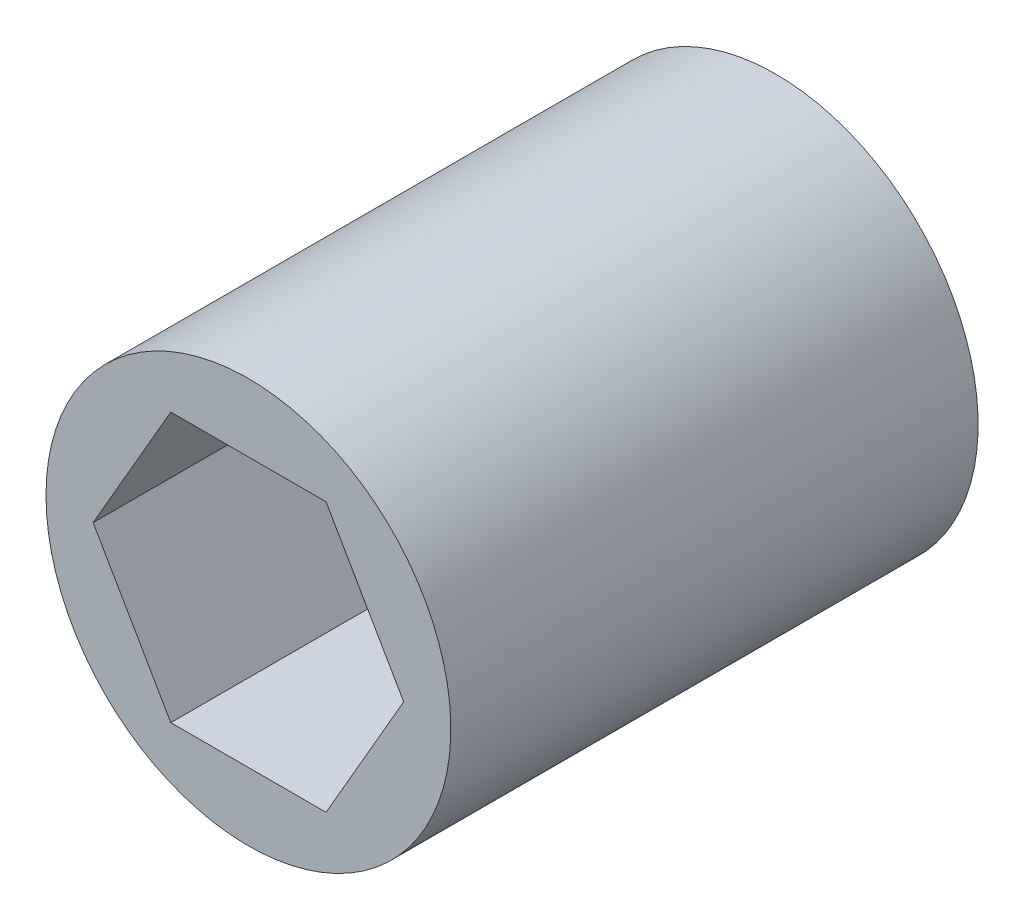
ISO-10303-21;
HEADER;
FILE_DESCRIPTION(('STEP AP214'),'2;1');
FILE_NAME('part.step','',(''),(''),'','','');
FILE_SCHEMA(('AUTOMOTIVE_DESIGN { 1 0 10303 214 1 1 1 1 }'));
ENDSEC;
DATA;
#1=APPLICATION_CONTEXT('core data for automotive mechanical design processes');
#2=APPLICATION_PROTOCOL_DEFINITION('international standard','automotive_design',2000,#1);
#3=PRODUCT_CONTEXT('',#1,'mechanical');
#4=PRODUCT('Part','Part','',(#3));
#5=PRODUCT_RELATED_PRODUCT_CATEGORY('part','',(#4));
#6=PRODUCT_DEFINITION_FORMATION('','',#4);
#7=PRODUCT_DEFINITION_CONTEXT('part definition',#1,'design');
#8=PRODUCT_DEFINITION('design','',#6,#7);
#9=PRODUCT_DEFINITION_SHAPE('','',#8);
#10=(LENGTH_UNIT() NAMED_UNIT(*) SI_UNIT(.MILLI.,.METRE.));
#11=(NAMED_UNIT(*) PLANE_ANGLE_UNIT() SI_UNIT($,.RADIAN.));
#12=(NAMED_UNIT(*) SI_UNIT($,.STERADIAN.) SOLID_ANGLE_UNIT());
#13=UNCERTAINTY_MEASURE_WITH_UNIT(LENGTH_MEASURE(1.E-05),#10,'distance_accuracy_value','');
#14=(GEOMETRIC_REPRESENTATION_CONTEXT(3) GLOBAL_UNCERTAINTY_ASSIGNED_CONTEXT((#13)) GLOBAL_UNIT_ASSIGNED_CONTEXT((#10,
#11,#12)) REPRESENTATION_CONTEXT('',''));
#15=CARTESIAN_POINT('',(0.,0.,0.));
#16=DIRECTION('',(0.,0.,1.));
#17=DIRECTION('',(1.,0.,0.));
#18=AXIS2_PLACEMENT_3D('',#15,#16,#17);
#19=CARTESIAN_POINT('',(-7.47899538708241,0.,12.7));
#20=DIRECTION('',(0.866025403784439,0.5,0.));
#21=DIRECTION('',(-0.5,0.866025403784439,0.));
#22=AXIS2_PLACEMENT_3D('',#19,#20,#21);
#23=PLANE('',#22);
#24=DIRECTION('',(-0.5,0.866025403784438,0.));
#25=VECTOR('',#24,1.);
#26=CARTESIAN_POINT('',(-3.73949769354121,-6.477,12.7));
#27=LINE('',#26,#25);
#28=CARTESIAN_POINT('',(-3.73949769354121,-6.477,12.7));
#29=VERTEX_POINT('',#28);
#30=CARTESIAN_POINT('',(-7.47899538708241,0.,12.7));
#31=VERTEX_POINT('',#30);
#32=EDGE_CURVE('E83',#29,#31,#27,.T.);
#33=ORIENTED_EDGE('',*,*,#32,.F.);
#34=DIRECTION('',(0.,0.,1.));
#35=VECTOR('',#34,1.);
#36=CARTESIAN_POINT('',(-3.73949769354121,-6.477,12.7));
#37=LINE('',#36,#35);
#38=CARTESIAN_POINT('',(-3.73949769354121,-6.477,-12.7));
#39=VERTEX_POINT('',#38);
#40=EDGE_CURVE('E75',#39,#29,#37,.T.);
#41=ORIENTED_EDGE('',*,*,#40,.F.);
#42=DIRECTION('',(-0.5,0.866025403784439,0.));
#43=VECTOR('',#42,1.);
#44=CARTESIAN_POINT('',(-3.73949769354121,-6.477,-12.7));
#45=LINE('',#44,#43);
#46=CARTESIAN_POINT('',(-7.47899538708241,0.,-12.7));
#47=VERTEX_POINT('',#46);
#48=EDGE_CURVE('E115',#39,#47,#45,.T.);
#49=ORIENTED_EDGE('',*,*,#48,.T.);
#50=DIRECTION('',(0.,0.,1.));
#51=VECTOR('',#50,1.);
#52=CARTESIAN_POINT('',(-7.47899538708241,0.,12.7));
#53=LINE('',#52,#51);
#54=EDGE_CURVE('E100',#31,#47,#53,.F.);
#55=ORIENTED_EDGE('',*,*,#54,.F.);
#56=EDGE_LOOP('',(#33,#41,#49,#55));
#57=FACE_BOUND('',#56,.T.);
#58=ADVANCED_FACE('F16',(#57),#23,.T.);
#59=CARTESIAN_POINT('',(-3.73949769354121,6.477,12.7));
#60=DIRECTION('',(0.866025403784439,-0.5,0.));
#61=DIRECTION('',(0.5,0.866025403784439,0.));
#62=AXIS2_PLACEMENT_3D('',#59,#60,#61);
#63=PLANE('',#62);
#64=DIRECTION('',(0.5,0.866025403784439,0.));
#65=VECTOR('',#64,1.);
#66=CARTESIAN_POINT('',(-7.47899538708242,0.,12.7));
#67=LINE('',#66,#65);
#68=CARTESIAN_POINT('',(-3.73949769354121,6.477,12.7));
#69=VERTEX_POINT('',#68);
#70=EDGE_CURVE('E108',#31,#69,#67,.T.);
#71=ORIENTED_EDGE('',*,*,#70,.F.);
#72=ORIENTED_EDGE('',*,*,#54,.T.);
#73=DIRECTION('',(0.5,0.866025403784439,0.));
#74=VECTOR('',#73,1.);
#75=CARTESIAN_POINT('',(-7.47899538708241,0.,-12.7));
#76=LINE('',#75,#74);
#77=CARTESIAN_POINT('',(-3.73949769354121,6.477,-12.7));
#78=VERTEX_POINT('',#77);
#79=EDGE_CURVE('E106',#47,#78,#76,.T.);
#80=ORIENTED_EDGE('',*,*,#79,.T.);
#81=DIRECTION('',(0.,0.,1.));
#82=VECTOR('',#81,1.);
#83=CARTESIAN_POINT('',(-3.73949769354121,6.477,12.7));
#84=LINE('',#83,#82);
#85=EDGE_CURVE('E97',#69,#78,#84,.F.);
#86=ORIENTED_EDGE('',*,*,#85,.F.);
#87=EDGE_LOOP('',(#71,#72,#80,#86));
#88=FACE_BOUND('',#87,.T.);
#89=ADVANCED_FACE('F105',(#88),#63,.T.);
#90=CARTESIAN_POINT('',(3.7394976935412,6.477,12.7));
#91=DIRECTION('',(0.,-1.,0.));
#92=DIRECTION('',(1.,0.,0.));
#93=AXIS2_PLACEMENT_3D('',#90,#91,#92);
#94=PLANE('',#93);
#95=DIRECTION('',(1.,0.,0.));
#96=VECTOR('',#95,1.);
#97=CARTESIAN_POINT('',(0.,6.477,12.7));
#98=LINE('',#97,#96);
#99=CARTESIAN_POINT('',(3.7394976935412,6.477,12.7));
#100=VERTEX_POINT('',#99);
#101=EDGE_CURVE('E125',#69,#100,#98,.T.);
#102=ORIENTED_EDGE('',*,*,#101,.F.);
#103=ORIENTED_EDGE('',*,*,#85,.T.);
#104=DIRECTION('',(1.,0.,0.));
#105=VECTOR('',#104,1.);
#106=CARTESIAN_POINT('',(0.,6.477,-12.7));
#107=LINE('',#106,#105);
#108=CARTESIAN_POINT('',(3.7394976935412,6.477,-12.7));
#109=VERTEX_POINT('',#108);
#110=EDGE_CURVE('E117',#78,#109,#107,.T.);
#111=ORIENTED_EDGE('',*,*,#110,.T.);
#112=DIRECTION('',(0.,0.,1.));
#113=VECTOR('',#112,1.);
#114=CARTESIAN_POINT('',(3.7394976935412,6.47700000000001,12.7));
#115=LINE('',#114,#113);
#116=EDGE_CURVE('E94',#100,#109,#115,.F.);
#117=ORIENTED_EDGE('',*,*,#116,.F.);
#118=EDGE_LOOP('',(#102,#103,#111,#117));
#119=FACE_BOUND('',#118,.T.);
#120=ADVANCED_FACE('F134',(#119),#94,.T.);
#121=CARTESIAN_POINT('',(7.47899538708241,0.,12.7));
#122=DIRECTION('',(-0.866025403784439,-0.5,0.));
#123=DIRECTION('',(0.5,-0.866025403784439,0.));
#124=AXIS2_PLACEMENT_3D('',#121,#122,#123);
#125=PLANE('',#124);
#126=DIRECTION('',(0.5,-0.866025403784438,0.));
#127=VECTOR('',#126,1.);
#128=CARTESIAN_POINT('',(3.7394976935412,6.477,12.7));
#129=LINE('',#128,#127);
#130=CARTESIAN_POINT('',(7.47899538708242,0.,12.7));
#131=VERTEX_POINT('',#130);
#132=EDGE_CURVE('E88',#100,#131,#129,.T.);
#133=ORIENTED_EDGE('',*,*,#132,.F.);
#134=ORIENTED_EDGE('',*,*,#116,.T.);
#135=DIRECTION('',(0.5,-0.866025403784438,0.));
#136=VECTOR('',#135,1.);
#137=CARTESIAN_POINT('',(3.7394976935412,6.477,-12.7));
#138=LINE('',#137,#136);
#139=CARTESIAN_POINT('',(7.47899538708241,0.,-12.7));
#140=VERTEX_POINT('',#139);
#141=EDGE_CURVE('E119',#109,#140,#138,.T.);
#142=ORIENTED_EDGE('',*,*,#141,.T.);
#143=DIRECTION('',(0.,0.,1.));
#144=VECTOR('',#143,1.);
#145=CARTESIAN_POINT('',(7.47899538708242,0.,12.7));
#146=LINE('',#145,#144);
#147=EDGE_CURVE('E64',#131,#140,#146,.F.);
#148=ORIENTED_EDGE('',*,*,#147,.F.);
#149=EDGE_LOOP('',(#133,#134,#142,#148));
#150=FACE_BOUND('',#149,.T.);
#151=ADVANCED_FACE('F131',(#150),#125,.T.);
#152=CARTESIAN_POINT('',(3.73949769354121,-6.477,12.7));
#153=DIRECTION('',(-0.866025403784439,0.5,0.));
#154=DIRECTION('',(-0.5,-0.866025403784439,0.));
#155=AXIS2_PLACEMENT_3D('',#152,#153,#154);
#156=PLANE('',#155);
#157=DIRECTION('',(-0.5,-0.866025403784439,0.));
#158=VECTOR('',#157,1.);
#159=CARTESIAN_POINT('',(7.47899538708241,0.,12.7));
#160=LINE('',#159,#158);
#161=CARTESIAN_POINT('',(3.73949769354121,-6.477,12.7));
#162=VERTEX_POINT('',#161);
#163=EDGE_CURVE('E70',#131,#162,#160,.T.);
#164=ORIENTED_EDGE('',*,*,#163,.F.);
#165=ORIENTED_EDGE('',*,*,#147,.T.);
#166=DIRECTION('',(-0.5,-0.866025403784439,0.));
#167=VECTOR('',#166,1.);
#168=CARTESIAN_POINT('',(7.47899538708241,0.,-12.7));
#169=LINE('',#168,#167);
#170=CARTESIAN_POINT('',(3.73949769354121,-6.477,-12.7));
#171=VERTEX_POINT('',#170);
#172=EDGE_CURVE('E32',#140,#171,#169,.T.);
#173=ORIENTED_EDGE('',*,*,#172,.T.);
#174=DIRECTION('',(0.,0.,1.));
#175=VECTOR('',#174,1.);
#176=CARTESIAN_POINT('',(3.73949769354121,-6.477,12.7));
#177=LINE('',#176,#175);
#178=EDGE_CURVE('E66',#162,#171,#177,.F.);
#179=ORIENTED_EDGE('',*,*,#178,.F.);
#180=EDGE_LOOP('',(#164,#165,#173,#179));
#181=FACE_BOUND('',#180,.T.);
#182=ADVANCED_FACE('F68',(#181),#156,.T.);
#183=CARTESIAN_POINT('',(-3.73949769354121,-6.477,12.7));
#184=DIRECTION('',(0.,1.,0.));
#185=DIRECTION('',(0.,0.,1.));
#186=AXIS2_PLACEMENT_3D('',#183,#184,#185);
#187=PLANE('',#186);
#188=DIRECTION('',(1.,0.,0.));
#189=VECTOR('',#188,1.);
#190=CARTESIAN_POINT('',(0.,-6.477,12.7));
#191=LINE('',#190,#189);
#192=EDGE_CURVE('E78',#162,#29,#191,.F.);
#193=ORIENTED_EDGE('',*,*,#192,.F.);
#194=ORIENTED_EDGE('',*,*,#178,.T.);
#195=DIRECTION('',(1.,0.,0.));
#196=VECTOR('',#195,1.);
#197=CARTESIAN_POINT('',(0.,-6.477,-12.7));
#198=LINE('',#197,#196);
#199=EDGE_CURVE('E127',#171,#39,#198,.F.);
#200=ORIENTED_EDGE('',*,*,#199,.T.);
#201=ORIENTED_EDGE('',*,*,#40,.T.);
#202=EDGE_LOOP('',(#193,#194,#200,#201));
#203=FACE_BOUND('',#202,.T.);
#204=ADVANCED_FACE('F79',(#203),#187,.T.);
#205=CARTESIAN_POINT('',(0.,0.,12.7));
#206=DIRECTION('',(0.,0.,1.));
#207=DIRECTION('',(1.,0.,0.));
#208=AXIS2_PLACEMENT_3D('',#205,#206,#207);
#209=PLANE('',#208);
#210=ORIENTED_EDGE('',*,*,#101,.T.);
#211=ORIENTED_EDGE('',*,*,#132,.T.);
#212=ORIENTED_EDGE('',*,*,#163,.T.);
#213=ORIENTED_EDGE('',*,*,#192,.T.);
#214=ORIENTED_EDGE('',*,*,#32,.T.);
#215=ORIENTED_EDGE('',*,*,#70,.T.);
#216=EDGE_LOOP('',(#210,#211,#212,#213,#214,#215));
#217=FACE_BOUND('',#216,.T.);
#218=CARTESIAN_POINT('',(0.,0.,12.7));
#219=DIRECTION('',(0.,0.,-1.));
#220=DIRECTION('',(-1.,0.,0.));
#221=AXIS2_PLACEMENT_3D('',#218,#219,#220);
#222=CIRCLE('',#221,9.75);
#223=CARTESIAN_POINT('',(-9.75,0.,12.7));
#224=VERTEX_POINT('',#223);
#225=EDGE_CURVE('E19',#224,#224,#222,.T.);
#226=ORIENTED_EDGE('',*,*,#225,.F.);
#227=EDGE_LOOP('',(#226));
#228=FACE_BOUND('',#227,.T.);
#229=ADVANCED_FACE('F86',(#217,#228),#209,.T.);
#230=CARTESIAN_POINT('',(0.,0.,-12.7));
#231=DIRECTION('',(0.,0.,1.));
#232=DIRECTION('',(1.,0.,0.));
#233=AXIS2_PLACEMENT_3D('',#230,#231,#232);
#234=PLANE('',#233);
#235=ORIENTED_EDGE('',*,*,#172,.F.);
#236=ORIENTED_EDGE('',*,*,#141,.F.);
#237=ORIENTED_EDGE('',*,*,#110,.F.);
#238=ORIENTED_EDGE('',*,*,#79,.F.);
#239=ORIENTED_EDGE('',*,*,#48,.F.);
#240=ORIENTED_EDGE('',*,*,#199,.F.);
#241=EDGE_LOOP('',(#235,#236,#237,#238,#239,#240));
#242=FACE_BOUND('',#241,.T.);
#243=CARTESIAN_POINT('',(0.,0.,-12.7));
#244=DIRECTION('',(0.,0.,-1.));
#245=DIRECTION('',(-1.,0.,0.));
#246=AXIS2_PLACEMENT_3D('',#243,#244,#245);
#247=CIRCLE('',#246,9.75);
#248=CARTESIAN_POINT('',(-9.75,0.,-12.7));
#249=VERTEX_POINT('',#248);
#250=EDGE_CURVE('E10',#249,#249,#247,.F.);
#251=ORIENTED_EDGE('',*,*,#250,.F.);
#252=EDGE_LOOP('',(#251));
#253=FACE_BOUND('',#252,.T.);
#254=ADVANCED_FACE('F113',(#242,#253),#234,.F.);
#255=CARTESIAN_POINT('',(0.,0.,12.7));
#256=DIRECTION('',(0.,0.,-1.));
#257=DIRECTION('',(-1.,0.,0.));
#258=AXIS2_PLACEMENT_3D('',#255,#256,#257);
#259=CYLINDRICAL_SURFACE('',#258,9.75);
#260=ORIENTED_EDGE('',*,*,#250,.T.);
#261=EDGE_LOOP('',(#260));
#262=FACE_BOUND('',#261,.T.);
#263=ORIENTED_EDGE('',*,*,#225,.T.);
#264=EDGE_LOOP('',(#263));
#265=FACE_BOUND('',#264,.T.);
#266=ADVANCED_FACE('F143',(#262,#265),#259,.T.);
#267=CLOSED_SHELL('',(#58,#89,#120,#151,#182,#204,#229,#254,#266));
#268=MANIFOLD_SOLID_BREP('B1',#267);
#269=ADVANCED_BREP_SHAPE_REPRESENTATION('',(#18,#268),#14);
#270=SHAPE_DEFINITION_REPRESENTATION(#9,#269);
ENDSEC;
END-ISO-10303-21;
